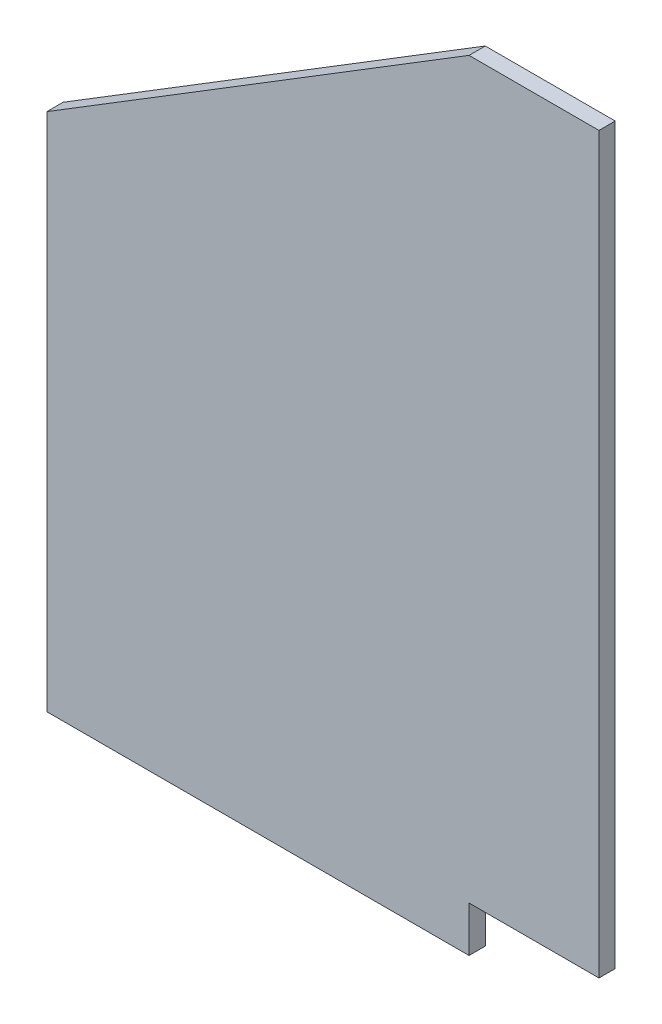
ISO-10303-21;
HEADER;
FILE_DESCRIPTION(('STEP AP214'),'2;1');
FILE_NAME('part.step','',(''),(''),'','','');
FILE_SCHEMA(('AUTOMOTIVE_DESIGN { 1 0 10303 214 1 1 1 1 }'));
ENDSEC;
DATA;
#1=APPLICATION_CONTEXT('core data for automotive mechanical design processes');
#2=APPLICATION_PROTOCOL_DEFINITION('international standard','automotive_design',2000,#1);
#3=PRODUCT_CONTEXT('',#1,'mechanical');
#4=PRODUCT('Part','Part','',(#3));
#5=PRODUCT_RELATED_PRODUCT_CATEGORY('part','',(#4));
#6=PRODUCT_DEFINITION_FORMATION('','',#4);
#7=PRODUCT_DEFINITION_CONTEXT('part definition',#1,'design');
#8=PRODUCT_DEFINITION('design','',#6,#7);
#9=PRODUCT_DEFINITION_SHAPE('','',#8);
#10=(LENGTH_UNIT() NAMED_UNIT(*) SI_UNIT(.MILLI.,.METRE.));
#11=(NAMED_UNIT(*) PLANE_ANGLE_UNIT() SI_UNIT($,.RADIAN.));
#12=(NAMED_UNIT(*) SI_UNIT($,.STERADIAN.) SOLID_ANGLE_UNIT());
#13=UNCERTAINTY_MEASURE_WITH_UNIT(LENGTH_MEASURE(1.E-05),#10,'distance_accuracy_value','');
#14=(GEOMETRIC_REPRESENTATION_CONTEXT(3) GLOBAL_UNCERTAINTY_ASSIGNED_CONTEXT((#13)) GLOBAL_UNIT_ASSIGNED_CONTEXT((#10,
#11,#12)) REPRESENTATION_CONTEXT('',''));
#15=CARTESIAN_POINT('',(0.,0.,0.));
#16=DIRECTION('',(0.,0.,1.));
#17=DIRECTION('',(1.,0.,0.));
#18=AXIS2_PLACEMENT_3D('',#15,#16,#17);
#19=CARTESIAN_POINT('',(-25.4,0.,3.175));
#20=DIRECTION('',(0.,1.,0.));
#21=DIRECTION('',(0.,0.,1.));
#22=AXIS2_PLACEMENT_3D('',#19,#20,#21);
#23=PLANE('',#22);
#24=DIRECTION('',(1.,0.,0.));
#25=VECTOR('',#24,1.);
#26=CARTESIAN_POINT('',(-25.4,0.,0.));
#27=LINE('',#26,#25);
#28=CARTESIAN_POINT('',(-25.4,0.,0.));
#29=VERTEX_POINT('',#28);
#30=CARTESIAN_POINT('',(0.,0.,0.));
#31=VERTEX_POINT('',#30);
#32=EDGE_CURVE('E135',#29,#31,#27,.T.);
#33=ORIENTED_EDGE('',*,*,#32,.T.);
#34=DIRECTION('',(0.,0.,-1.));
#35=VECTOR('',#34,1.);
#36=CARTESIAN_POINT('',(0.,0.,3.175));
#37=LINE('',#36,#35);
#38=CARTESIAN_POINT('',(0.,0.,3.175));
#39=VERTEX_POINT('',#38);
#40=EDGE_CURVE('E11',#39,#31,#37,.T.);
#41=ORIENTED_EDGE('',*,*,#40,.F.);
#42=DIRECTION('',(1.,0.,0.));
#43=VECTOR('',#42,1.);
#44=CARTESIAN_POINT('',(-25.4,0.,3.175));
#45=LINE('',#44,#43);
#46=CARTESIAN_POINT('',(-25.4,0.,3.175));
#47=VERTEX_POINT('',#46);
#48=EDGE_CURVE('E154',#47,#39,#45,.T.);
#49=ORIENTED_EDGE('',*,*,#48,.F.);
#50=DIRECTION('',(0.,0.,-1.));
#51=VECTOR('',#50,1.);
#52=CARTESIAN_POINT('',(-25.4,0.,3.175));
#53=LINE('',#52,#51);
#54=EDGE_CURVE('E131',#47,#29,#53,.T.);
#55=ORIENTED_EDGE('',*,*,#54,.T.);
#56=EDGE_LOOP('',(#33,#41,#49,#55));
#57=FACE_BOUND('',#56,.T.);
#58=ADVANCED_FACE('F39',(#57),#23,.F.);
#59=CARTESIAN_POINT('',(0.,0.,3.175));
#60=DIRECTION('',(-1.,0.,0.));
#61=DIRECTION('',(0.,0.,1.));
#62=AXIS2_PLACEMENT_3D('',#59,#60,#61);
#63=PLANE('',#62);
#64=DIRECTION('',(0.,1.,0.));
#65=VECTOR('',#64,1.);
#66=CARTESIAN_POINT('',(0.,0.,0.));
#67=LINE('',#66,#65);
#68=CARTESIAN_POINT('',(0.,143.51,0.));
#69=VERTEX_POINT('',#68);
#70=EDGE_CURVE('E139',#31,#69,#67,.T.);
#71=ORIENTED_EDGE('',*,*,#70,.T.);
#72=DIRECTION('',(0.,0.,-1.));
#73=VECTOR('',#72,1.);
#74=CARTESIAN_POINT('',(0.,143.51,3.175));
#75=LINE('',#74,#73);
#76=CARTESIAN_POINT('',(0.,143.51,3.175));
#77=VERTEX_POINT('',#76);
#78=EDGE_CURVE('E48',#77,#69,#75,.T.);
#79=ORIENTED_EDGE('',*,*,#78,.F.);
#80=DIRECTION('',(0.,1.,0.));
#81=VECTOR('',#80,1.);
#82=CARTESIAN_POINT('',(0.,0.,3.175));
#83=LINE('',#82,#81);
#84=EDGE_CURVE('E96',#39,#77,#83,.T.);
#85=ORIENTED_EDGE('',*,*,#84,.F.);
#86=ORIENTED_EDGE('',*,*,#40,.T.);
#87=EDGE_LOOP('',(#71,#79,#85,#86));
#88=FACE_BOUND('',#87,.T.);
#89=ADVANCED_FACE('F191',(#88),#63,.F.);
#90=CARTESIAN_POINT('',(0.,143.51,3.175));
#91=DIRECTION('',(0.,-1.,0.));
#92=DIRECTION('',(1.,0.,0.));
#93=AXIS2_PLACEMENT_3D('',#90,#91,#92);
#94=PLANE('',#93);
#95=DIRECTION('',(-1.,0.,0.));
#96=VECTOR('',#95,1.);
#97=CARTESIAN_POINT('',(0.,143.51,0.));
#98=LINE('',#97,#96);
#99=CARTESIAN_POINT('',(-25.4,143.51,0.));
#100=VERTEX_POINT('',#99);
#101=EDGE_CURVE('E142',#69,#100,#98,.T.);
#102=ORIENTED_EDGE('',*,*,#101,.T.);
#103=DIRECTION('',(0.,0.,-1.));
#104=VECTOR('',#103,1.);
#105=CARTESIAN_POINT('',(-25.4,143.51,3.175));
#106=LINE('',#105,#104);
#107=CARTESIAN_POINT('',(-25.4,143.51,3.175));
#108=VERTEX_POINT('',#107);
#109=EDGE_CURVE('E161',#108,#100,#106,.T.);
#110=ORIENTED_EDGE('',*,*,#109,.F.);
#111=DIRECTION('',(-1.,0.,0.));
#112=VECTOR('',#111,1.);
#113=CARTESIAN_POINT('',(0.,143.51,3.175));
#114=LINE('',#113,#112);
#115=EDGE_CURVE('E172',#77,#108,#114,.T.);
#116=ORIENTED_EDGE('',*,*,#115,.F.);
#117=ORIENTED_EDGE('',*,*,#78,.T.);
#118=EDGE_LOOP('',(#102,#110,#116,#117));
#119=FACE_BOUND('',#118,.T.);
#120=ADVANCED_FACE('F170',(#119),#94,.F.);
#121=CARTESIAN_POINT('',(-107.95,92.71,3.175));
#122=DIRECTION('',(0.524097425664335,-0.851658316704544,0.));
#123=DIRECTION('',(0.851658316704544,0.524097425664335,0.));
#124=AXIS2_PLACEMENT_3D('',#121,#122,#123);
#125=PLANE('',#124);
#126=DIRECTION('',(-0.851658316704544,-0.524097425664335,0.));
#127=VECTOR('',#126,1.);
#128=CARTESIAN_POINT('',(-107.95,92.71,0.));
#129=LINE('',#128,#127);
#130=CARTESIAN_POINT('',(-107.95,92.71,0.));
#131=VERTEX_POINT('',#130);
#132=EDGE_CURVE('E145',#100,#131,#129,.T.);
#133=ORIENTED_EDGE('',*,*,#132,.T.);
#134=DIRECTION('',(0.,0.,-1.));
#135=VECTOR('',#134,1.);
#136=CARTESIAN_POINT('',(-107.95,92.71,3.175));
#137=LINE('',#136,#135);
#138=CARTESIAN_POINT('',(-107.95,92.71,3.175));
#139=VERTEX_POINT('',#138);
#140=EDGE_CURVE('E123',#139,#131,#137,.T.);
#141=ORIENTED_EDGE('',*,*,#140,.F.);
#142=DIRECTION('',(-0.851658316704544,-0.524097425664335,0.));
#143=VECTOR('',#142,1.);
#144=CARTESIAN_POINT('',(-107.95,92.71,3.175));
#145=LINE('',#144,#143);
#146=EDGE_CURVE('E112',#108,#139,#145,.T.);
#147=ORIENTED_EDGE('',*,*,#146,.F.);
#148=ORIENTED_EDGE('',*,*,#109,.T.);
#149=EDGE_LOOP('',(#133,#141,#147,#148));
#150=FACE_BOUND('',#149,.T.);
#151=ADVANCED_FACE('F178',(#150),#125,.F.);
#152=CARTESIAN_POINT('',(-107.95,-8.88999999999997,3.175));
#153=DIRECTION('',(1.,0.,0.));
#154=DIRECTION('',(0.,0.,-1.));
#155=AXIS2_PLACEMENT_3D('',#152,#153,#154);
#156=PLANE('',#155);
#157=DIRECTION('',(0.,-1.,0.));
#158=VECTOR('',#157,1.);
#159=CARTESIAN_POINT('',(-107.95,-8.88999999999997,0.));
#160=LINE('',#159,#158);
#161=CARTESIAN_POINT('',(-107.95,-8.88999999999997,0.));
#162=VERTEX_POINT('',#161);
#163=EDGE_CURVE('E121',#131,#162,#160,.T.);
#164=ORIENTED_EDGE('',*,*,#163,.T.);
#165=DIRECTION('',(0.,0.,-1.));
#166=VECTOR('',#165,1.);
#167=CARTESIAN_POINT('',(-107.95,-8.88999999999997,3.175));
#168=LINE('',#167,#166);
#169=CARTESIAN_POINT('',(-107.95,-8.88999999999997,3.175));
#170=VERTEX_POINT('',#169);
#171=EDGE_CURVE('E118',#170,#162,#168,.T.);
#172=ORIENTED_EDGE('',*,*,#171,.F.);
#173=DIRECTION('',(0.,-1.,0.));
#174=VECTOR('',#173,1.);
#175=CARTESIAN_POINT('',(-107.95,-8.88999999999997,3.175));
#176=LINE('',#175,#174);
#177=EDGE_CURVE('E106',#139,#170,#176,.T.);
#178=ORIENTED_EDGE('',*,*,#177,.F.);
#179=ORIENTED_EDGE('',*,*,#140,.T.);
#180=EDGE_LOOP('',(#164,#172,#178,#179));
#181=FACE_BOUND('',#180,.T.);
#182=ADVANCED_FACE('F119',(#181),#156,.F.);
#183=CARTESIAN_POINT('',(-107.95,-8.88999999999997,3.175));
#184=DIRECTION('',(0.,1.,0.));
#185=DIRECTION('',(-1.,0.,0.));
#186=AXIS2_PLACEMENT_3D('',#183,#184,#185);
#187=PLANE('',#186);
#188=DIRECTION('',(1.,0.,0.));
#189=VECTOR('',#188,1.);
#190=CARTESIAN_POINT('',(-107.95,-8.88999999999997,0.));
#191=LINE('',#190,#189);
#192=CARTESIAN_POINT('',(-25.4,-8.88999999999998,0.));
#193=VERTEX_POINT('',#192);
#194=EDGE_CURVE('E82',#162,#193,#191,.T.);
#195=ORIENTED_EDGE('',*,*,#194,.T.);
#196=DIRECTION('',(0.,0.,-1.));
#197=VECTOR('',#196,1.);
#198=CARTESIAN_POINT('',(-25.4,-8.88999999999998,3.175));
#199=LINE('',#198,#197);
#200=CARTESIAN_POINT('',(-25.4,-8.88999999999998,3.175));
#201=VERTEX_POINT('',#200);
#202=EDGE_CURVE('E124',#201,#193,#199,.T.);
#203=ORIENTED_EDGE('',*,*,#202,.F.);
#204=DIRECTION('',(1.,0.,0.));
#205=VECTOR('',#204,1.);
#206=CARTESIAN_POINT('',(-107.95,-8.88999999999997,3.175));
#207=LINE('',#206,#205);
#208=EDGE_CURVE('E110',#170,#201,#207,.T.);
#209=ORIENTED_EDGE('',*,*,#208,.F.);
#210=ORIENTED_EDGE('',*,*,#171,.T.);
#211=EDGE_LOOP('',(#195,#203,#209,#210));
#212=FACE_BOUND('',#211,.T.);
#213=ADVANCED_FACE('F126',(#212),#187,.F.);
#214=CARTESIAN_POINT('',(-25.4,-8.88999999999998,3.175));
#215=DIRECTION('',(-1.,0.,0.));
#216=DIRECTION('',(0.,0.,1.));
#217=AXIS2_PLACEMENT_3D('',#214,#215,#216);
#218=PLANE('',#217);
#219=DIRECTION('',(0.,1.,0.));
#220=VECTOR('',#219,1.);
#221=CARTESIAN_POINT('',(-25.4,-8.88999999999998,0.));
#222=LINE('',#221,#220);
#223=EDGE_CURVE('E88',#193,#29,#222,.T.);
#224=ORIENTED_EDGE('',*,*,#223,.T.);
#225=ORIENTED_EDGE('',*,*,#54,.F.);
#226=DIRECTION('',(0.,1.,0.));
#227=VECTOR('',#226,1.);
#228=CARTESIAN_POINT('',(-25.4,-8.88999999999998,3.175));
#229=LINE('',#228,#227);
#230=EDGE_CURVE('E56',#201,#47,#229,.T.);
#231=ORIENTED_EDGE('',*,*,#230,.F.);
#232=ORIENTED_EDGE('',*,*,#202,.T.);
#233=EDGE_LOOP('',(#224,#225,#231,#232));
#234=FACE_BOUND('',#233,.T.);
#235=ADVANCED_FACE('F205',(#234),#218,.F.);
#236=CARTESIAN_POINT('',(0.,0.,3.175));
#237=DIRECTION('',(0.,0.,1.));
#238=DIRECTION('',(1.,0.,0.));
#239=AXIS2_PLACEMENT_3D('',#236,#237,#238);
#240=PLANE('',#239);
#241=ORIENTED_EDGE('',*,*,#48,.T.);
#242=ORIENTED_EDGE('',*,*,#84,.T.);
#243=ORIENTED_EDGE('',*,*,#115,.T.);
#244=ORIENTED_EDGE('',*,*,#146,.T.);
#245=ORIENTED_EDGE('',*,*,#177,.T.);
#246=ORIENTED_EDGE('',*,*,#208,.T.);
#247=ORIENTED_EDGE('',*,*,#230,.T.);
#248=EDGE_LOOP('',(#241,#242,#243,#244,#245,#246,#247));
#249=FACE_BOUND('',#248,.T.);
#250=ADVANCED_FACE('F108',(#249),#240,.T.);
#251=CARTESIAN_POINT('',(0.,0.,0.));
#252=DIRECTION('',(0.,0.,1.));
#253=DIRECTION('',(1.,0.,0.));
#254=AXIS2_PLACEMENT_3D('',#251,#252,#253);
#255=PLANE('',#254);
#256=ORIENTED_EDGE('',*,*,#32,.F.);
#257=ORIENTED_EDGE('',*,*,#223,.F.);
#258=ORIENTED_EDGE('',*,*,#194,.F.);
#259=ORIENTED_EDGE('',*,*,#163,.F.);
#260=ORIENTED_EDGE('',*,*,#132,.F.);
#261=ORIENTED_EDGE('',*,*,#101,.F.);
#262=ORIENTED_EDGE('',*,*,#70,.F.);
#263=EDGE_LOOP('',(#256,#257,#258,#259,#260,#261,#262));
#264=FACE_BOUND('',#263,.T.);
#265=ADVANCED_FACE('F176',(#264),#255,.F.);
#266=CLOSED_SHELL('',(#58,#89,#120,#151,#182,#213,#235,#250,#265));
#267=MANIFOLD_SOLID_BREP('B2',#266);
#268=ADVANCED_BREP_SHAPE_REPRESENTATION('',(#18,#267),#14);
#269=SHAPE_DEFINITION_REPRESENTATION(#9,#268);
ENDSEC;
END-ISO-10303-21;
